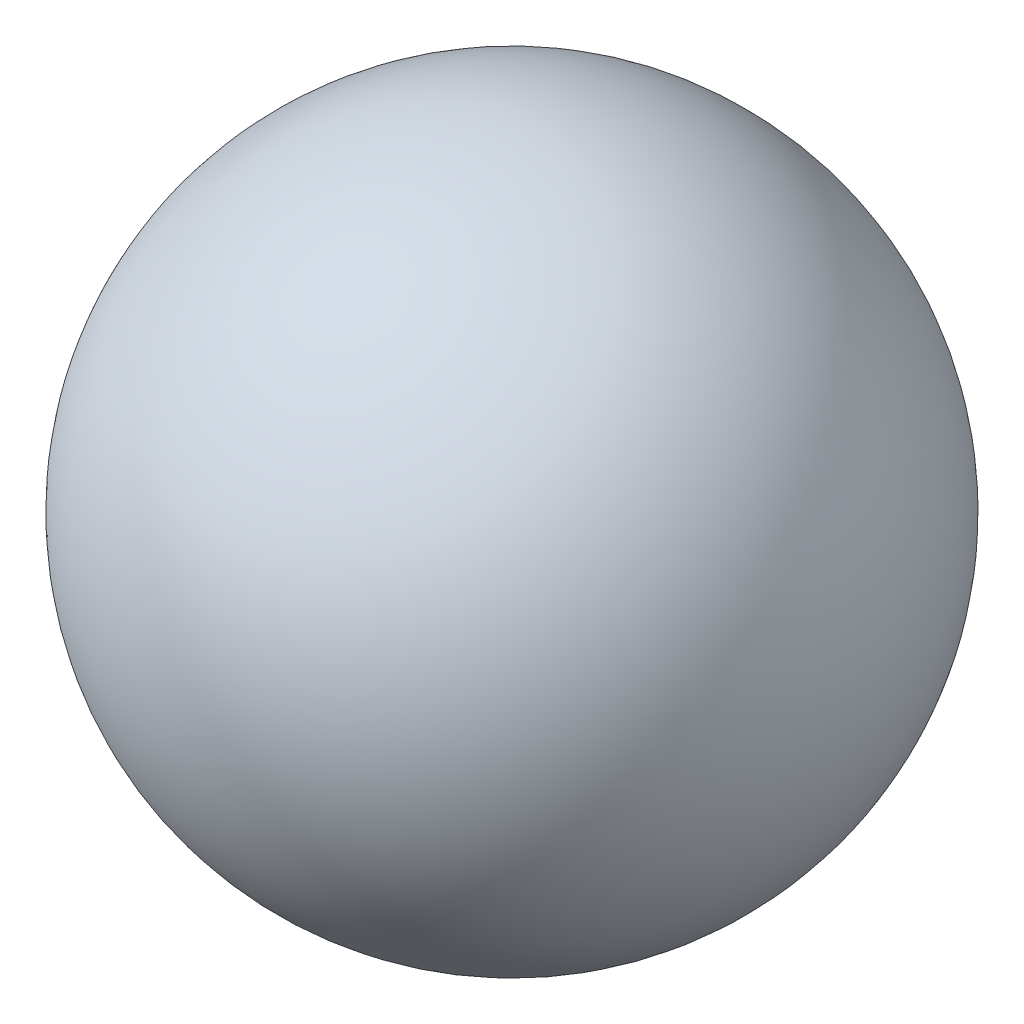
ISO-10303-21;
HEADER;
FILE_DESCRIPTION(('STEP AP214'),'2;1');
FILE_NAME('part.step','',(''),(''),'','','');
FILE_SCHEMA(('AUTOMOTIVE_DESIGN { 1 0 10303 214 1 1 1 1 }'));
ENDSEC;
DATA;
#1=APPLICATION_CONTEXT('core data for automotive mechanical design processes');
#2=APPLICATION_PROTOCOL_DEFINITION('international standard','automotive_design',2000,#1);
#3=PRODUCT_CONTEXT('',#1,'mechanical');
#4=PRODUCT('Part','Part','',(#3));
#5=PRODUCT_RELATED_PRODUCT_CATEGORY('part','',(#4));
#6=PRODUCT_DEFINITION_FORMATION('','',#4);
#7=PRODUCT_DEFINITION_CONTEXT('part definition',#1,'design');
#8=PRODUCT_DEFINITION('design','',#6,#7);
#9=PRODUCT_DEFINITION_SHAPE('','',#8);
#10=(LENGTH_UNIT() NAMED_UNIT(*) SI_UNIT(.MILLI.,.METRE.));
#11=(NAMED_UNIT(*) PLANE_ANGLE_UNIT() SI_UNIT($,.RADIAN.));
#12=(NAMED_UNIT(*) SI_UNIT($,.STERADIAN.) SOLID_ANGLE_UNIT());
#13=UNCERTAINTY_MEASURE_WITH_UNIT(LENGTH_MEASURE(1.E-05),#10,'distance_accuracy_value','');
#14=(GEOMETRIC_REPRESENTATION_CONTEXT(3) GLOBAL_UNCERTAINTY_ASSIGNED_CONTEXT((#13)) GLOBAL_UNIT_ASSIGNED_CONTEXT((#10,
#11,#12)) REPRESENTATION_CONTEXT('',''));
#15=CARTESIAN_POINT('',(0.,0.,0.));
#16=DIRECTION('',(0.,0.,1.));
#17=DIRECTION('',(1.,0.,0.));
#18=AXIS2_PLACEMENT_3D('',#15,#16,#17);
#19=CARTESIAN_POINT('',(2.5,9.75,0.));
#20=DIRECTION('',(-1.,0.,0.));
#21=DIRECTION('',(0.,1.,0.));
#22=AXIS2_PLACEMENT_3D('',#19,#20,#21);
#23=SPHERICAL_SURFACE('',#22,1.1905);
#24=CARTESIAN_POINT('',(1.3095,9.75,0.));
#25=VERTEX_POINT('',#24);
#26=VERTEX_LOOP('',#25);
#27=FACE_BOUND('',#26,.T.);
#28=ADVANCED_FACE('F31',(#27),#23,.T.);
#29=CLOSED_SHELL('',(#28));
#30=MANIFOLD_SOLID_BREP('B2',#29);
#31=ADVANCED_BREP_SHAPE_REPRESENTATION('',(#18,#30),#14);
#32=SHAPE_DEFINITION_REPRESENTATION(#9,#31);
ENDSEC;
END-ISO-10303-21;
